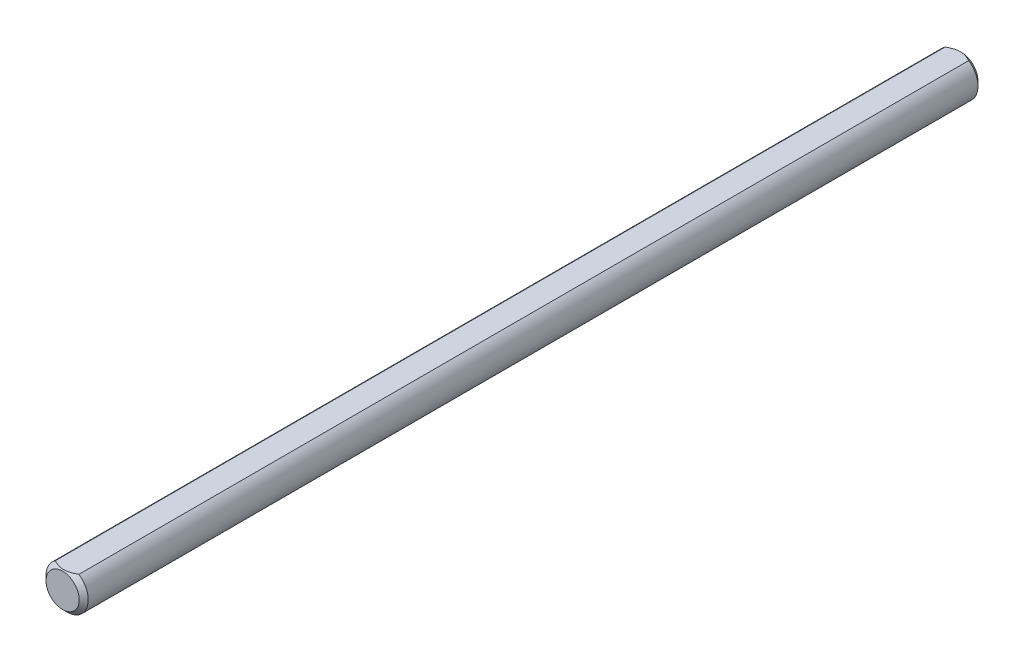
ISO-10303-21;
HEADER;
FILE_DESCRIPTION(('STEP AP214'),'2;1');
FILE_NAME('part.step','',(''),(''),'','','');
FILE_SCHEMA(('AUTOMOTIVE_DESIGN { 1 0 10303 214 1 1 1 1 }'));
ENDSEC;
DATA;
#1=APPLICATION_CONTEXT('core data for automotive mechanical design processes');
#2=APPLICATION_PROTOCOL_DEFINITION('international standard','automotive_design',2000,#1);
#3=PRODUCT_CONTEXT('',#1,'mechanical');
#4=PRODUCT('Part','Part','',(#3));
#5=PRODUCT_RELATED_PRODUCT_CATEGORY('part','',(#4));
#6=PRODUCT_DEFINITION_FORMATION('','',#4);
#7=PRODUCT_DEFINITION_CONTEXT('part definition',#1,'design');
#8=PRODUCT_DEFINITION('design','',#6,#7);
#9=PRODUCT_DEFINITION_SHAPE('','',#8);
#10=(LENGTH_UNIT() NAMED_UNIT(*) SI_UNIT(.MILLI.,.METRE.));
#11=(NAMED_UNIT(*) PLANE_ANGLE_UNIT() SI_UNIT($,.RADIAN.));
#12=(NAMED_UNIT(*) SI_UNIT($,.STERADIAN.) SOLID_ANGLE_UNIT());
#13=UNCERTAINTY_MEASURE_WITH_UNIT(LENGTH_MEASURE(1.E-05),#10,'distance_accuracy_value','');
#14=(GEOMETRIC_REPRESENTATION_CONTEXT(3) GLOBAL_UNCERTAINTY_ASSIGNED_CONTEXT((#13)) GLOBAL_UNIT_ASSIGNED_CONTEXT((#10,
#11,#12)) REPRESENTATION_CONTEXT('',''));
#15=CARTESIAN_POINT('',(0.,0.,0.));
#16=DIRECTION('',(0.,0.,1.));
#17=DIRECTION('',(1.,0.,0.));
#18=AXIS2_PLACEMENT_3D('',#15,#16,#17);
#19=CARTESIAN_POINT('',(0.,0.,100.));
#20=DIRECTION('',(0.,0.,-1.));
#21=DIRECTION('',(-1.,0.,0.));
#22=AXIS2_PLACEMENT_3D('',#19,#20,#21);
#23=CYLINDRICAL_SURFACE('',#22,2.35);
#24=DIRECTION('',(0.,0.,-1.));
#25=VECTOR('',#24,1.);
#26=CARTESIAN_POINT('',(-1.3114877048604,1.95,100.));
#27=LINE('',#26,#25);
#28=CARTESIAN_POINT('',(-1.3114877048604,1.95,99.5));
#29=VERTEX_POINT('',#28);
#30=CARTESIAN_POINT('',(-1.3114877048604,1.95,0.500000000000014));
#31=VERTEX_POINT('',#30);
#32=EDGE_CURVE('E70',#29,#31,#27,.T.);
#33=ORIENTED_EDGE('',*,*,#32,.T.);
#34=CARTESIAN_POINT('',(0.,0.,0.500000000000014));
#35=DIRECTION('',(0.,0.,1.));
#36=DIRECTION('',(1.,0.,0.));
#37=AXIS2_PLACEMENT_3D('',#34,#35,#36);
#38=CIRCLE('',#37,2.35);
#39=CARTESIAN_POINT('',(1.3114877048604,1.95,0.500000000000014));
#40=VERTEX_POINT('',#39);
#41=EDGE_CURVE('E75',#31,#40,#38,.T.);
#42=ORIENTED_EDGE('',*,*,#41,.T.);
#43=DIRECTION('',(0.,0.,-1.));
#44=VECTOR('',#43,1.);
#45=CARTESIAN_POINT('',(1.3114877048604,1.95,100.));
#46=LINE('',#45,#44);
#47=CARTESIAN_POINT('',(1.3114877048604,1.95,99.5));
#48=VERTEX_POINT('',#47);
#49=EDGE_CURVE('E68',#48,#40,#46,.T.);
#50=ORIENTED_EDGE('',*,*,#49,.F.);
#51=CARTESIAN_POINT('',(0.,0.,99.5));
#52=DIRECTION('',(0.,0.,1.));
#53=DIRECTION('',(1.,0.,0.));
#54=AXIS2_PLACEMENT_3D('',#51,#52,#53);
#55=CIRCLE('',#54,2.35);
#56=EDGE_CURVE('E79',#48,#29,#55,.F.);
#57=ORIENTED_EDGE('',*,*,#56,.T.);
#58=EDGE_LOOP('',(#33,#42,#50,#57));
#59=FACE_BOUND('',#58,.T.);
#60=ADVANCED_FACE('F34',(#59),#23,.T.);
#61=CARTESIAN_POINT('',(-1.3114877048604,1.95,100.));
#62=DIRECTION('',(0.,-1.,0.));
#63=DIRECTION('',(0.,0.,-1.));
#64=AXIS2_PLACEMENT_3D('',#61,#62,#63);
#65=PLANE('',#64);
#66=ORIENTED_EDGE('',*,*,#49,.T.);
#67=CARTESIAN_POINT('',(1.3114877048604,1.95,0.500000000000014));
#68=CARTESIAN_POINT('',(1.24186199444796,1.95,0.461184130322142));
#69=CARTESIAN_POINT('',(1.17130329140962,1.95,0.423898281512031));
#70=CARTESIAN_POINT('',(1.02783437678538,1.95,0.353400682429586));
#71=CARTESIAN_POINT('',(0.954915763003841,1.95,0.320206132245913));
#72=CARTESIAN_POINT('',(0.805991356015546,1.95,0.258905183204697));
#73=CARTESIAN_POINT('',(0.729960444715389,1.95,0.230858701042052));
#74=CARTESIAN_POINT('',(0.575711028024674,1.95,0.18189924750248));
#75=CARTESIAN_POINT('',(0.497496181579769,1.95,0.160975038223076));
#76=CARTESIAN_POINT('',(0.360978386819589,1.95,0.132335485454047));
#77=CARTESIAN_POINT('',(0.303105604510447,1.95,0.122570768083109));
#78=CARTESIAN_POINT('',(0.186719623647888,1.95,0.108068970449472));
#79=CARTESIAN_POINT('',(0.128206415569054,1.95,0.103331965069756));
#80=CARTESIAN_POINT('',(0.0115200314193448,1.95,0.0991702052232018));
#81=CARTESIAN_POINT('',(-0.0466514199808594,1.95,0.0996976932847214));
#82=CARTESIAN_POINT('',(-0.162716592673138,1.95,0.105918130647676));
#83=CARTESIAN_POINT('',(-0.220610285115955,1.95,0.111611605314654));
#84=CARTESIAN_POINT('',(-0.349064475231908,1.95,0.129753118375793));
#85=CARTESIAN_POINT('',(-0.419446914389738,1.95,0.14346196902316));
#86=CARTESIAN_POINT('',(-0.55865364178814,1.95,0.177319134563273));
#87=CARTESIAN_POINT('',(-0.627476943525148,1.95,0.197471410868664));
#88=CARTESIAN_POINT('',(-0.76453487905869,1.95,0.243506183110584));
#89=CARTESIAN_POINT('',(-0.832736594698686,1.95,0.269485331821687));
#90=CARTESIAN_POINT('',(-0.967245947079994,1.95,0.325853668612962));
#91=CARTESIAN_POINT('',(-1.0335540532767,1.95,0.356241752088084));
#92=CARTESIAN_POINT('',(-1.20886446981579,1.95,0.442304311211185));
#93=CARTESIAN_POINT('',(-1.31630507737125,1.95,0.501144737818683));
#94=CARTESIAN_POINT('',(-1.52730447073875,1.95,0.625460203626468));
#95=CARTESIAN_POINT('',(-1.63085989578122,1.95,0.690940813357033));
#96=CARTESIAN_POINT('',(-1.83533451507384,1.95,0.826769763133087));
#97=CARTESIAN_POINT('',(-1.93624073237506,1.95,0.897137488604184));
#98=CARTESIAN_POINT('',(-2.13562726377768,1.95,1.04113431861876));
#99=CARTESIAN_POINT('',(-2.23410839594914,1.95,1.11476229924022));
#100=CARTESIAN_POINT('',(-2.42012123747289,1.95,1.25745458534222));
#101=CARTESIAN_POINT('',(-2.50781802791511,1.95,1.32630470673523));
#102=CARTESIAN_POINT('',(-2.68199106609492,1.95,1.46554544799764));
#103=CARTESIAN_POINT('',(-2.76846719359378,1.95,1.53593621790732));
#104=CARTESIAN_POINT('',(-2.9396130729065,1.95,1.67725264309277));
#105=CARTESIAN_POINT('',(-3.02429216714751,1.95,1.74816701406623));
#106=CARTESIAN_POINT('',(-3.19282127637167,1.95,1.89094053041495));
#107=CARTESIAN_POINT('',(-3.2766714561222,1.95,1.96279948113523));
#108=CARTESIAN_POINT('',(-3.36019867555132,1.95,2.035027044845));
#109=B_SPLINE_CURVE_WITH_KNOTS('',3,(#67,#68,#69,#70,#71,#72,#73,#74,#75,#76,#77,#78,#79,#80,
#81,#82,#83,#84,#85,#86,#87,#88,#89,#90,#91,#92,#93,#94,#95,#96,#97,#98,#99,#100,#101,#102,#103,
#104,#105,#106,#107,#108),.UNSPECIFIED.,.F.,.F.,(4,2,2,2,2,2,2,2,2,2,2,2,2,2,2,2,2,2,2,2,4),(0.,
0.239229764027314,0.479433240807,0.72227608602954,0.964733965120964,1.1406111196414,
1.31649089364782,1.49077661442202,1.66508006152481,1.87983034477806,2.09471291101507,
2.31346500187174,2.53216238138598,2.89926429818466,3.26667676978251,3.63564054868715,
4.00447810854701,4.33894128420745,4.67343717870438,5.00478221917632,5.33606001584401),.UNSPECIFIED.);
#110=EDGE_CURVE('E74',#40,#31,#109,.T.);
#111=ORIENTED_EDGE('',*,*,#110,.T.);
#112=ORIENTED_EDGE('',*,*,#32,.F.);
#113=CARTESIAN_POINT('',(-1.3114877048604,1.95,99.5));
#114=CARTESIAN_POINT('',(-1.24186199444796,1.95,99.5388158696779));
#115=CARTESIAN_POINT('',(-1.17130329140962,1.95,99.576101718488));
#116=CARTESIAN_POINT('',(-1.02783437678537,1.95,99.6465993175704));
#117=CARTESIAN_POINT('',(-0.954915763003833,1.95,99.6797938677541));
#118=CARTESIAN_POINT('',(-0.805991356015538,1.95,99.7410948167953));
#119=CARTESIAN_POINT('',(-0.729960444715382,1.95,99.7691412989579));
#120=CARTESIAN_POINT('',(-0.575711028024667,1.95,99.8181007524975));
#121=CARTESIAN_POINT('',(-0.497496181579762,1.95,99.8390249617769));
#122=CARTESIAN_POINT('',(-0.360978386819579,1.95,99.867664514546));
#123=CARTESIAN_POINT('',(-0.303105604510436,1.95,99.8774292319169));
#124=CARTESIAN_POINT('',(-0.186719623647876,1.95,99.8919310295505));
#125=CARTESIAN_POINT('',(-0.12820641556904,1.95,99.8966680349302));
#126=CARTESIAN_POINT('',(-0.0115200314193299,1.95,99.9008297947768));
#127=CARTESIAN_POINT('',(0.0466514199808755,1.95,99.9003023067153));
#128=CARTESIAN_POINT('',(0.162716592673155,1.95,99.8940818693523));
#129=CARTESIAN_POINT('',(0.220610285115973,1.95,99.8883883946854));
#130=CARTESIAN_POINT('',(0.349064475231928,1.95,99.8702468816242));
#131=CARTESIAN_POINT('',(0.41944691438976,1.95,99.8565380309768));
#132=CARTESIAN_POINT('',(0.558653641788167,1.95,99.8226808654367));
#133=CARTESIAN_POINT('',(0.627476943525176,1.95,99.8025285891313));
#134=CARTESIAN_POINT('',(0.764534879058723,1.95,99.7564938168894));
#135=CARTESIAN_POINT('',(0.832736594698723,1.95,99.7305146681783));
#136=CARTESIAN_POINT('',(0.967245947080033,1.95,99.674146331387));
#137=CARTESIAN_POINT('',(1.03355405327674,1.95,99.6437582479119));
#138=CARTESIAN_POINT('',(1.20886446981583,1.95,99.5576956887888));
#139=CARTESIAN_POINT('',(1.31630507737129,1.95,99.4988552621813));
#140=CARTESIAN_POINT('',(1.5273044707388,1.95,99.3745397963735));
#141=CARTESIAN_POINT('',(1.63085989578128,1.95,99.3090591866429));
#142=CARTESIAN_POINT('',(1.8353345150739,1.95,99.1732302368669));
#143=CARTESIAN_POINT('',(1.93624073237513,1.95,99.1028625113958));
#144=CARTESIAN_POINT('',(2.13562726377776,1.95,98.9588656813812));
#145=CARTESIAN_POINT('',(2.23410839594923,1.95,98.8852377007597));
#146=CARTESIAN_POINT('',(2.420121237473,1.95,98.7425454146577));
#147=CARTESIAN_POINT('',(2.50781802791521,1.95,98.6736952932647));
#148=CARTESIAN_POINT('',(2.68199106609504,1.95,98.5344545520023));
#149=CARTESIAN_POINT('',(2.76846719359391,1.95,98.4640637820926));
#150=CARTESIAN_POINT('',(2.93961307290663,1.95,98.3227473569071));
#151=CARTESIAN_POINT('',(3.02429216714765,1.95,98.2518329859337));
#152=CARTESIAN_POINT('',(3.19282127637181,1.95,98.1090594695849));
#153=CARTESIAN_POINT('',(3.27667145612236,1.95,98.0372005188647));
#154=CARTESIAN_POINT('',(3.36019867555148,1.95,97.9649729551549));
#155=B_SPLINE_CURVE_WITH_KNOTS('',3,(#113,#114,#115,#116,#117,#118,#119,#120,#121,#122,#123,
#124,#125,#126,#127,#128,#129,#130,#131,#132,#133,#134,#135,#136,#137,#138,#139,#140,#141,#142,
#143,#144,#145,#146,#147,#148,#149,#150,#151,#152,#153,#154),.UNSPECIFIED.,.F.,.F.,(4,2,2,2,2,2,
2,2,2,2,2,2,2,2,2,2,2,2,2,2,4),(0.,0.23922976402732,0.479433240807009,0.722276086029545,
0.964733965120973,1.14061111964141,1.31649089364783,1.49077661442204,1.66508006152483,
1.87983034477808,2.0947129110151,2.31346500187178,2.53216238138602,2.89926429818471,
3.26667676978258,3.63564054868724,4.00447810854712,4.33894128420758,4.67343717870454,
5.0047822191765,5.33606001584421),.UNSPECIFIED.);
#156=EDGE_CURVE('E65',#29,#48,#155,.T.);
#157=ORIENTED_EDGE('',*,*,#156,.T.);
#158=EDGE_LOOP('',(#66,#111,#112,#157));
#159=FACE_BOUND('',#158,.T.);
#160=ADVANCED_FACE('F67',(#159),#65,.F.);
#161=CARTESIAN_POINT('',(0.,0.,100.));
#162=DIRECTION('',(0.,0.,1.));
#163=DIRECTION('',(1.,0.,0.));
#164=AXIS2_PLACEMENT_3D('',#161,#162,#163);
#165=PLANE('',#164);
#166=CARTESIAN_POINT('',(0.,0.,100.));
#167=DIRECTION('',(0.,0.,1.));
#168=DIRECTION('',(1.,0.,0.));
#169=AXIS2_PLACEMENT_3D('',#166,#167,#168);
#170=CIRCLE('',#169,1.84999999999999);
#171=CARTESIAN_POINT('',(-1.03244776765605,1.53510638297872,100.));
#172=VERTEX_POINT('',#171);
#173=EDGE_CURVE('E11',#172,#172,#170,.T.);
#174=ORIENTED_EDGE('',*,*,#173,.T.);
#175=EDGE_LOOP('',(#174));
#176=FACE_BOUND('',#175,.T.);
#177=ADVANCED_FACE('F97',(#176),#165,.T.);
#178=CARTESIAN_POINT('',(0.,0.,0.));
#179=DIRECTION('',(0.,0.,1.));
#180=DIRECTION('',(1.,0.,0.));
#181=AXIS2_PLACEMENT_3D('',#178,#179,#180);
#182=PLANE('',#181);
#183=CARTESIAN_POINT('',(0.,0.,0.));
#184=DIRECTION('',(0.,0.,1.));
#185=DIRECTION('',(1.,0.,0.));
#186=AXIS2_PLACEMENT_3D('',#183,#184,#185);
#187=CIRCLE('',#186,1.84999999999999);
#188=CARTESIAN_POINT('',(-1.03244776765605,1.53510638297872,0.));
#189=VERTEX_POINT('',#188);
#190=EDGE_CURVE('E43',#189,#189,#187,.F.);
#191=ORIENTED_EDGE('',*,*,#190,.T.);
#192=EDGE_LOOP('',(#191));
#193=FACE_BOUND('',#192,.T.);
#194=ADVANCED_FACE('F98',(#193),#182,.F.);
#195=CARTESIAN_POINT('',(0.,0.,0.500000000000014));
#196=DIRECTION('',(0.,0.,1.));
#197=DIRECTION('',(1.,0.,0.));
#198=AXIS2_PLACEMENT_3D('',#195,#196,#197);
#199=CONICAL_SURFACE('',#198,2.35,0.785398163397443);
#200=ORIENTED_EDGE('',*,*,#190,.F.);
#201=EDGE_LOOP('',(#200));
#202=FACE_BOUND('',#201,.T.);
#203=ORIENTED_EDGE('',*,*,#110,.F.);
#204=ORIENTED_EDGE('',*,*,#41,.F.);
#205=EDGE_LOOP('',(#203,#204));
#206=FACE_BOUND('',#205,.T.);
#207=ADVANCED_FACE('F102',(#202,#206),#199,.T.);
#208=CARTESIAN_POINT('',(0.,0.,100.));
#209=DIRECTION('',(0.,0.,-1.));
#210=DIRECTION('',(-1.,0.,0.));
#211=AXIS2_PLACEMENT_3D('',#208,#209,#210);
#212=CONICAL_SURFACE('',#211,1.84999999999999,0.785398163397448);
#213=ORIENTED_EDGE('',*,*,#156,.F.);
#214=ORIENTED_EDGE('',*,*,#56,.F.);
#215=EDGE_LOOP('',(#213,#214));
#216=FACE_BOUND('',#215,.T.);
#217=ORIENTED_EDGE('',*,*,#173,.F.);
#218=EDGE_LOOP('',(#217));
#219=FACE_BOUND('',#218,.T.);
#220=ADVANCED_FACE('F36',(#216,#219),#212,.T.);
#221=CLOSED_SHELL('',(#60,#160,#177,#194,#207,#220));
#222=MANIFOLD_SOLID_BREP('B2',#221);
#223=ADVANCED_BREP_SHAPE_REPRESENTATION('',(#18,#222),#14);
#224=SHAPE_DEFINITION_REPRESENTATION(#9,#223);
ENDSEC;
END-ISO-10303-21;
